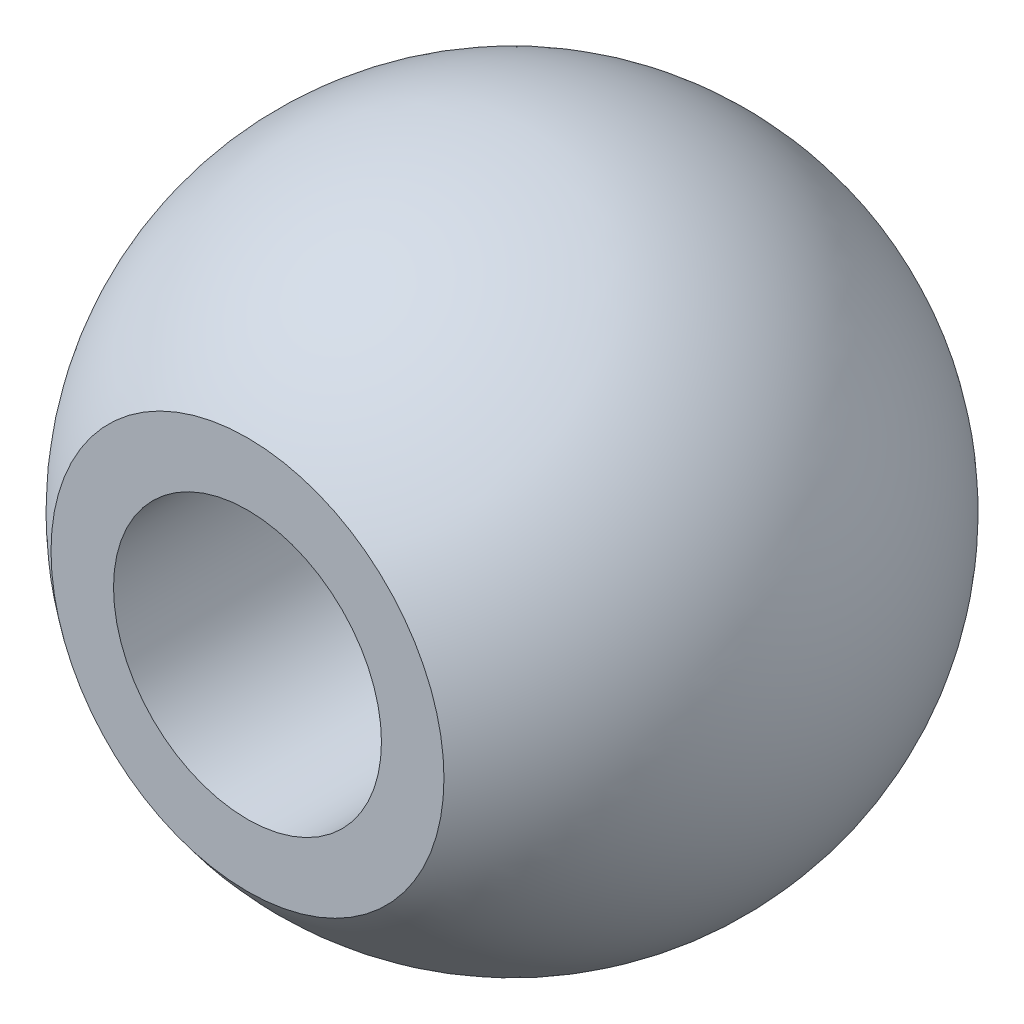
ISO-10303-21;
HEADER;
FILE_DESCRIPTION(('STEP AP214'),'2;1');
FILE_NAME('part.step','',(''),(''),'','','');
FILE_SCHEMA(('AUTOMOTIVE_DESIGN { 1 0 10303 214 1 1 1 1 }'));
ENDSEC;
DATA;
#1=APPLICATION_CONTEXT('core data for automotive mechanical design processes');
#2=APPLICATION_PROTOCOL_DEFINITION('international standard','automotive_design',2000,#1);
#3=PRODUCT_CONTEXT('',#1,'mechanical');
#4=PRODUCT('Part','Part','',(#3));
#5=PRODUCT_RELATED_PRODUCT_CATEGORY('part','',(#4));
#6=PRODUCT_DEFINITION_FORMATION('','',#4);
#7=PRODUCT_DEFINITION_CONTEXT('part definition',#1,'design');
#8=PRODUCT_DEFINITION('design','',#6,#7);
#9=PRODUCT_DEFINITION_SHAPE('','',#8);
#10=(LENGTH_UNIT() NAMED_UNIT(*) SI_UNIT(.MILLI.,.METRE.));
#11=(NAMED_UNIT(*) PLANE_ANGLE_UNIT() SI_UNIT($,.RADIAN.));
#12=(NAMED_UNIT(*) SI_UNIT($,.STERADIAN.) SOLID_ANGLE_UNIT());
#13=UNCERTAINTY_MEASURE_WITH_UNIT(LENGTH_MEASURE(1.E-05),#10,'distance_accuracy_value','');
#14=(GEOMETRIC_REPRESENTATION_CONTEXT(3) GLOBAL_UNCERTAINTY_ASSIGNED_CONTEXT((#13)) GLOBAL_UNIT_ASSIGNED_CONTEXT((#10,
#11,#12)) REPRESENTATION_CONTEXT('',''));
#15=CARTESIAN_POINT('',(0.,0.,0.));
#16=DIRECTION('',(0.,0.,1.));
#17=DIRECTION('',(1.,0.,0.));
#18=AXIS2_PLACEMENT_3D('',#15,#16,#17);
#19=CARTESIAN_POINT('',(0.,0.,10.));
#20=DIRECTION('',(0.,0.,-1.));
#21=DIRECTION('',(-1.,0.,0.));
#22=AXIS2_PLACEMENT_3D('',#19,#20,#21);
#23=CYLINDRICAL_SURFACE('',#22,1.);
#24=CARTESIAN_POINT('',(0.,0.,1.975));
#25=DIRECTION('',(0.,0.,-1.));
#26=DIRECTION('',(-1.,0.,0.));
#27=AXIS2_PLACEMENT_3D('',#24,#25,#26);
#28=CIRCLE('',#27,1.);
#29=CARTESIAN_POINT('',(-1.,0.,1.975));
#30=VERTEX_POINT('',#29);
#31=EDGE_CURVE('E46',#30,#30,#28,.T.);
#32=ORIENTED_EDGE('',*,*,#31,.F.);
#33=EDGE_LOOP('',(#32));
#34=FACE_BOUND('',#33,.T.);
#35=CARTESIAN_POINT('',(0.,0.,-1.975));
#36=DIRECTION('',(0.,0.,1.));
#37=DIRECTION('',(1.,0.,0.));
#38=AXIS2_PLACEMENT_3D('',#35,#36,#37);
#39=CIRCLE('',#38,1.);
#40=CARTESIAN_POINT('',(1.,0.,-1.975));
#41=VERTEX_POINT('',#40);
#42=EDGE_CURVE('E56',#41,#41,#39,.T.);
#43=ORIENTED_EDGE('',*,*,#42,.F.);
#44=EDGE_LOOP('',(#43));
#45=FACE_BOUND('',#44,.T.);
#46=ADVANCED_FACE('F42',(#34,#45),#23,.F.);
#47=CARTESIAN_POINT('',(3.29620637790771,10.,-1.975));
#48=DIRECTION('',(0.,0.,1.));
#49=DIRECTION('',(1.,0.,0.));
#50=AXIS2_PLACEMENT_3D('',#47,#48,#49);
#51=PLANE('',#50);
#52=CARTESIAN_POINT('',(0.,0.,-1.975));
#53=DIRECTION('',(0.,0.,1.));
#54=DIRECTION('',(1.,0.,0.));
#55=AXIS2_PLACEMENT_3D('',#52,#53,#54);
#56=CIRCLE('',#55,1.46662026441748);
#57=CARTESIAN_POINT('',(1.46662026441747,0.,-1.975));
#58=VERTEX_POINT('',#57);
#59=EDGE_CURVE('E54',#58,#58,#56,.F.);
#60=ORIENTED_EDGE('',*,*,#59,.T.);
#61=EDGE_LOOP('',(#60));
#62=FACE_BOUND('',#61,.T.);
#63=ORIENTED_EDGE('',*,*,#42,.T.);
#64=EDGE_LOOP('',(#63));
#65=FACE_BOUND('',#64,.T.);
#66=ADVANCED_FACE('F63',(#62,#65),#51,.F.);
#67=CARTESIAN_POINT('',(3.29620637790771,10.,1.975));
#68=DIRECTION('',(0.,0.,-1.));
#69=DIRECTION('',(-1.,0.,0.));
#70=AXIS2_PLACEMENT_3D('',#67,#68,#69);
#71=PLANE('',#70);
#72=CARTESIAN_POINT('',(0.,0.,1.975));
#73=DIRECTION('',(0.,0.,-1.));
#74=DIRECTION('',(-1.,0.,0.));
#75=AXIS2_PLACEMENT_3D('',#72,#73,#74);
#76=CIRCLE('',#75,1.46662026441748);
#77=CARTESIAN_POINT('',(-1.46662026441747,0.,1.975));
#78=VERTEX_POINT('',#77);
#79=EDGE_CURVE('E11',#78,#78,#76,.F.);
#80=ORIENTED_EDGE('',*,*,#79,.T.);
#81=EDGE_LOOP('',(#80));
#82=FACE_BOUND('',#81,.T.);
#83=ORIENTED_EDGE('',*,*,#31,.T.);
#84=EDGE_LOOP('',(#83));
#85=FACE_BOUND('',#84,.T.);
#86=ADVANCED_FACE('F66',(#82,#85),#71,.F.);
#87=CARTESIAN_POINT('',(0.,0.,0.));
#88=DIRECTION('',(0.,1.,0.));
#89=DIRECTION('',(1.,0.,0.));
#90=AXIS2_PLACEMENT_3D('',#87,#88,#89);
#91=SPHERICAL_SURFACE('',#90,2.46);
#92=CARTESIAN_POINT('',(0.,0.,0.));
#93=DIRECTION('',(0.,0.,-1.));
#94=DIRECTION('',(-1.,0.,0.));
#95=AXIS2_PLACEMENT_3D('',#92,#93,#94);
#96=SPHERICAL_SURFACE('',#95,2.46);
#97=ORIENTED_EDGE('',*,*,#79,.F.);
#98=EDGE_LOOP('',(#97));
#99=FACE_BOUND('',#98,.T.);
#100=ORIENTED_EDGE('',*,*,#59,.F.);
#101=EDGE_LOOP('',(#100));
#102=FACE_BOUND('',#101,.T.);
#103=ADVANCED_FACE('F44',(#99,#102),#96,.T.);
#104=CLOSED_SHELL('',(#46,#66,#86,#103));
#105=MANIFOLD_SOLID_BREP('B2',#104);
#106=ADVANCED_BREP_SHAPE_REPRESENTATION('',(#18,#105),#14);
#107=SHAPE_DEFINITION_REPRESENTATION(#9,#106);
ENDSEC;
END-ISO-10303-21;
